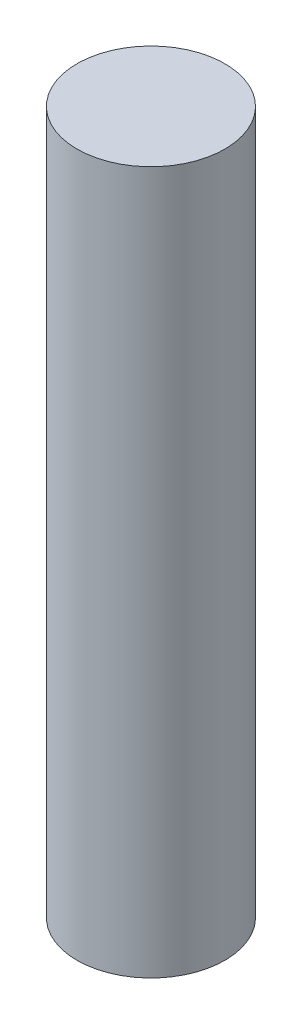
ISO-10303-21;
HEADER;
FILE_DESCRIPTION(('STEP AP214'),'2;1');
FILE_NAME('part.step','',(''),(''),'','','');
FILE_SCHEMA(('AUTOMOTIVE_DESIGN { 1 0 10303 214 1 1 1 1 }'));
ENDSEC;
DATA;
#1=APPLICATION_CONTEXT('core data for automotive mechanical design processes');
#2=APPLICATION_PROTOCOL_DEFINITION('international standard','automotive_design',2000,#1);
#3=PRODUCT_CONTEXT('',#1,'mechanical');
#4=PRODUCT('Part','Part','',(#3));
#5=PRODUCT_RELATED_PRODUCT_CATEGORY('part','',(#4));
#6=PRODUCT_DEFINITION_FORMATION('','',#4);
#7=PRODUCT_DEFINITION_CONTEXT('part definition',#1,'design');
#8=PRODUCT_DEFINITION('design','',#6,#7);
#9=PRODUCT_DEFINITION_SHAPE('','',#8);
#10=(LENGTH_UNIT() NAMED_UNIT(*) SI_UNIT(.MILLI.,.METRE.));
#11=(NAMED_UNIT(*) PLANE_ANGLE_UNIT() SI_UNIT($,.RADIAN.));
#12=(NAMED_UNIT(*) SI_UNIT($,.STERADIAN.) SOLID_ANGLE_UNIT());
#13=UNCERTAINTY_MEASURE_WITH_UNIT(LENGTH_MEASURE(1.E-05),#10,'distance_accuracy_value','');
#14=(GEOMETRIC_REPRESENTATION_CONTEXT(3) GLOBAL_UNCERTAINTY_ASSIGNED_CONTEXT((#13)) GLOBAL_UNIT_ASSIGNED_CONTEXT((#10,
#11,#12)) REPRESENTATION_CONTEXT('',''));
#15=CARTESIAN_POINT('',(0.,0.,0.));
#16=DIRECTION('',(0.,0.,1.));
#17=DIRECTION('',(1.,0.,0.));
#18=AXIS2_PLACEMENT_3D('',#15,#16,#17);
#19=CARTESIAN_POINT('',(0.,9.5,0.));
#20=DIRECTION('',(0.,-1.,0.));
#21=DIRECTION('',(0.,0.,-1.));
#22=AXIS2_PLACEMENT_3D('',#19,#20,#21);
#23=CYLINDRICAL_SURFACE('',#22,1.);
#24=CARTESIAN_POINT('',(0.,9.5,0.));
#25=DIRECTION('',(0.,1.,0.));
#26=DIRECTION('',(0.,0.,1.));
#27=AXIS2_PLACEMENT_3D('',#24,#25,#26);
#28=CIRCLE('',#27,1.);
#29=CARTESIAN_POINT('',(0.,9.5,1.));
#30=VERTEX_POINT('',#29);
#31=EDGE_CURVE('E12',#30,#30,#28,.T.);
#32=ORIENTED_EDGE('',*,*,#31,.F.);
#33=EDGE_LOOP('',(#32));
#34=FACE_BOUND('',#33,.T.);
#35=CARTESIAN_POINT('',(0.,0.,0.));
#36=DIRECTION('',(0.,1.,0.));
#37=DIRECTION('',(0.,0.,1.));
#38=AXIS2_PLACEMENT_3D('',#35,#36,#37);
#39=CIRCLE('',#38,1.);
#40=CARTESIAN_POINT('',(0.,0.,1.));
#41=VERTEX_POINT('',#40);
#42=EDGE_CURVE('E43',#41,#41,#39,.T.);
#43=ORIENTED_EDGE('',*,*,#42,.T.);
#44=EDGE_LOOP('',(#43));
#45=FACE_BOUND('',#44,.T.);
#46=ADVANCED_FACE('F40',(#34,#45),#23,.T.);
#47=CARTESIAN_POINT('',(0.,9.5,0.));
#48=DIRECTION('',(0.,1.,0.));
#49=DIRECTION('',(0.,0.,1.));
#50=AXIS2_PLACEMENT_3D('',#47,#48,#49);
#51=PLANE('',#50);
#52=ORIENTED_EDGE('',*,*,#31,.T.);
#53=EDGE_LOOP('',(#52));
#54=FACE_BOUND('',#53,.T.);
#55=ADVANCED_FACE('F55',(#54),#51,.T.);
#56=CARTESIAN_POINT('',(0.,0.,0.));
#57=DIRECTION('',(0.,1.,0.));
#58=DIRECTION('',(0.,0.,1.));
#59=AXIS2_PLACEMENT_3D('',#56,#57,#58);
#60=PLANE('',#59);
#61=ORIENTED_EDGE('',*,*,#42,.F.);
#62=EDGE_LOOP('',(#61));
#63=FACE_BOUND('',#62,.T.);
#64=ADVANCED_FACE('F53',(#63),#60,.F.);
#65=CLOSED_SHELL('',(#46,#55,#64));
#66=MANIFOLD_SOLID_BREP('B2',#65);
#67=ADVANCED_BREP_SHAPE_REPRESENTATION('',(#18,#66),#14);
#68=SHAPE_DEFINITION_REPRESENTATION(#9,#67);
ENDSEC;
END-ISO-10303-21;
